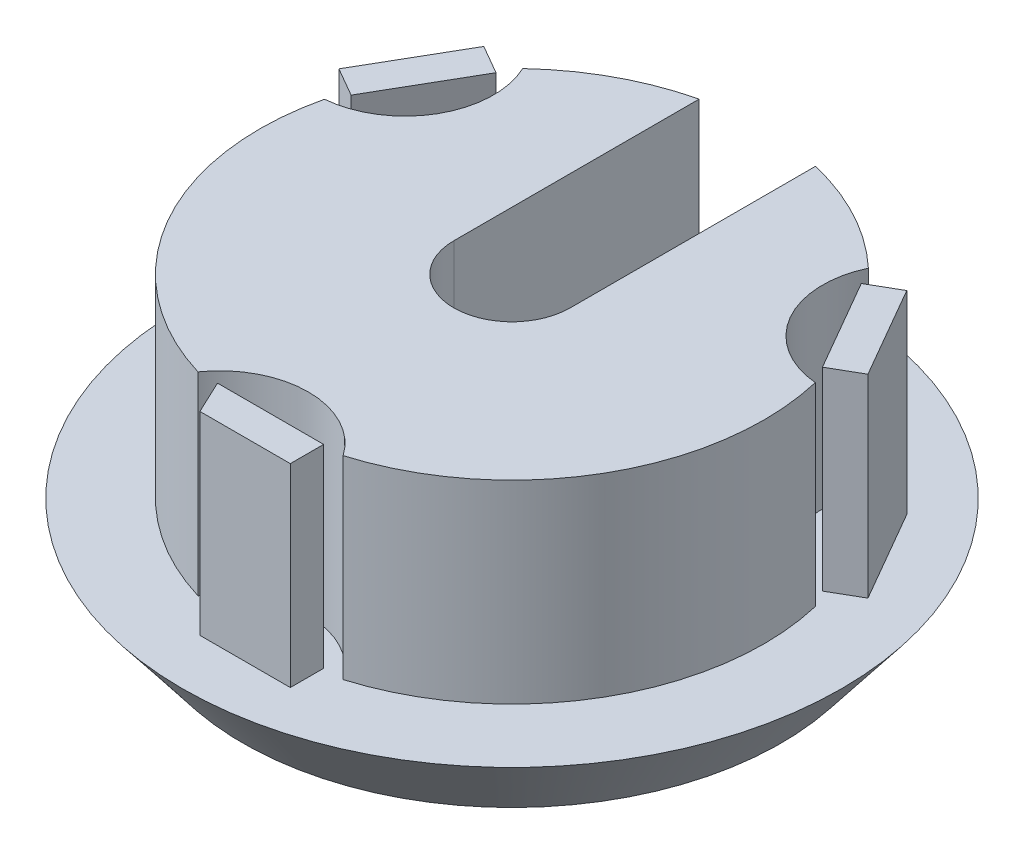
ISO-10303-21;
HEADER;
FILE_DESCRIPTION(('STEP AP214'),'2;1');
FILE_NAME('part.step','',(''),(''),'','','');
FILE_SCHEMA(('AUTOMOTIVE_DESIGN { 1 0 10303 214 1 1 1 1 }'));
ENDSEC;
DATA;
#1=APPLICATION_CONTEXT('core data for automotive mechanical design processes');
#2=APPLICATION_PROTOCOL_DEFINITION('international standard','automotive_design',2000,#1);
#3=PRODUCT_CONTEXT('',#1,'mechanical');
#4=PRODUCT('Part','Part','',(#3));
#5=PRODUCT_RELATED_PRODUCT_CATEGORY('part','',(#4));
#6=PRODUCT_DEFINITION_FORMATION('','',#4);
#7=PRODUCT_DEFINITION_CONTEXT('part definition',#1,'design');
#8=PRODUCT_DEFINITION('design','',#6,#7);
#9=PRODUCT_DEFINITION_SHAPE('','',#8);
#10=(LENGTH_UNIT() NAMED_UNIT(*) SI_UNIT(.MILLI.,.METRE.));
#11=(NAMED_UNIT(*) PLANE_ANGLE_UNIT() SI_UNIT($,.RADIAN.));
#12=(NAMED_UNIT(*) SI_UNIT($,.STERADIAN.) SOLID_ANGLE_UNIT());
#13=UNCERTAINTY_MEASURE_WITH_UNIT(LENGTH_MEASURE(1.E-05),#10,'distance_accuracy_value','');
#14=(GEOMETRIC_REPRESENTATION_CONTEXT(3) GLOBAL_UNCERTAINTY_ASSIGNED_CONTEXT((#13)) GLOBAL_UNIT_ASSIGNED_CONTEXT((#10,
#11,#12)) REPRESENTATION_CONTEXT('',''));
#15=CARTESIAN_POINT('',(0.,0.,0.));
#16=DIRECTION('',(0.,0.,1.));
#17=DIRECTION('',(1.,0.,0.));
#18=AXIS2_PLACEMENT_3D('',#15,#16,#17);
#19=CARTESIAN_POINT('',(-0.684205723735482,5.,1.18507907633929));
#20=DIRECTION('',(-0.5,0.,0.866025403784439));
#21=DIRECTION('',(0.866025403784439,0.,0.5));
#22=AXIS2_PLACEMENT_3D('',#19,#20,#21);
#23=PLANE('',#22);
#24=DIRECTION('',(-0.866025403784439,0.,-0.5));
#25=VECTOR('',#24,1.);
#26=CARTESIAN_POINT('',(-0.684205723735482,0.,1.18507907633929));
#27=LINE('',#26,#25);
#28=CARTESIAN_POINT('',(-6.07574411526303,0.,-1.92772706535534));
#29=VERTEX_POINT('',#28);
#30=CARTESIAN_POINT('',(-6.81906569315333,0.,-2.35688397844476));
#31=VERTEX_POINT('',#30);
#32=EDGE_CURVE('E111',#29,#31,#27,.T.);
#33=ORIENTED_EDGE('',*,*,#32,.F.);
#34=DIRECTION('',(0.,-1.,0.));
#35=VECTOR('',#34,1.);
#36=CARTESIAN_POINT('',(-6.07574411526303,5.,-1.92772706535534));
#37=LINE('',#36,#35);
#38=CARTESIAN_POINT('',(-6.07574411526303,5.,-1.92772706535534));
#39=VERTEX_POINT('',#38);
#40=EDGE_CURVE('E12',#39,#29,#37,.T.);
#41=ORIENTED_EDGE('',*,*,#40,.F.);
#42=DIRECTION('',(-0.866025403784439,0.,-0.5));
#43=VECTOR('',#42,1.);
#44=CARTESIAN_POINT('',(-0.684205723735482,5.,1.18507907633929));
#45=LINE('',#44,#43);
#46=CARTESIAN_POINT('',(-6.81906569315333,5.,-2.35688397844476));
#47=VERTEX_POINT('',#46);
#48=EDGE_CURVE('E96',#39,#47,#45,.T.);
#49=ORIENTED_EDGE('',*,*,#48,.T.);
#50=DIRECTION('',(0.,-1.,0.));
#51=VECTOR('',#50,1.);
#52=CARTESIAN_POINT('',(-6.81906569315333,5.,-2.35688397844476));
#53=LINE('',#52,#51);
#54=EDGE_CURVE('E64',#47,#31,#53,.T.);
#55=ORIENTED_EDGE('',*,*,#54,.T.);
#56=EDGE_LOOP('',(#33,#41,#49,#55));
#57=FACE_BOUND('',#56,.T.);
#58=ADVANCED_FACE('F48',(#57),#23,.T.);
#59=CARTESIAN_POINT('',(-5.39078812254303,5.,-3.11362759871968));
#60=DIRECTION('',(-0.865938123768216,0.,-0.500151142960588));
#61=DIRECTION('',(-0.500151142960588,0.,0.865938123768216));
#62=AXIS2_PLACEMENT_3D('',#59,#60,#61);
#63=PLANE('',#62);
#64=DIRECTION('',(0.500151142960588,0.,-0.865938123768216));
#65=VECTOR('',#64,1.);
#66=CARTESIAN_POINT('',(-5.39078812254303,0.,-3.11362759871968));
#67=LINE('',#66,#65);
#68=CARTESIAN_POINT('',(-4.70811447355037,0.,-4.29557658890527));
#69=VERTEX_POINT('',#68);
#70=EDGE_CURVE('E102',#29,#69,#67,.T.);
#71=ORIENTED_EDGE('',*,*,#70,.T.);
#72=DIRECTION('',(0.,-1.,0.));
#73=VECTOR('',#72,1.);
#74=CARTESIAN_POINT('',(-4.70811447355037,5.,-4.29557658890527));
#75=LINE('',#74,#73);
#76=CARTESIAN_POINT('',(-4.70811447355037,5.,-4.29557658890527));
#77=VERTEX_POINT('',#76);
#78=EDGE_CURVE('E56',#77,#69,#75,.T.);
#79=ORIENTED_EDGE('',*,*,#78,.F.);
#80=DIRECTION('',(0.500151142960588,0.,-0.865938123768216));
#81=VECTOR('',#80,1.);
#82=CARTESIAN_POINT('',(-5.39078812254303,5.,-3.11362759871968));
#83=LINE('',#82,#81);
#84=EDGE_CURVE('E90',#39,#77,#83,.T.);
#85=ORIENTED_EDGE('',*,*,#84,.F.);
#86=ORIENTED_EDGE('',*,*,#40,.T.);
#87=EDGE_LOOP('',(#71,#79,#85,#86));
#88=FACE_BOUND('',#87,.T.);
#89=ADVANCED_FACE('F100',(#88),#63,.F.);
#90=CARTESIAN_POINT('',(0.682673648652947,5.,-1.18194899038173));
#91=DIRECTION('',(-0.500151142960587,0.,0.865938123768216));
#92=DIRECTION('',(0.865938123768216,0.,0.500151142960587));
#93=AXIS2_PLACEMENT_3D('',#90,#91,#92);
#94=PLANE('',#93);
#95=DIRECTION('',(-0.865938123768216,0.,-0.500151142960587));
#96=VECTOR('',#95,1.);
#97=CARTESIAN_POINT('',(0.682673648652947,0.,-1.18194899038173));
#98=LINE('',#97,#96);
#99=CARTESIAN_POINT('',(-5.45136112681533,0.,-4.72486322374517));
#100=VERTEX_POINT('',#99);
#101=EDGE_CURVE('E114',#69,#100,#98,.T.);
#102=ORIENTED_EDGE('',*,*,#101,.T.);
#103=DIRECTION('',(0.,-1.,0.));
#104=VECTOR('',#103,1.);
#105=CARTESIAN_POINT('',(-5.45136112681533,5.,-4.72486322374517));
#106=LINE('',#105,#104);
#107=CARTESIAN_POINT('',(-5.45136112681533,5.,-4.72486322374517));
#108=VERTEX_POINT('',#107);
#109=EDGE_CURVE('E78',#108,#100,#106,.T.);
#110=ORIENTED_EDGE('',*,*,#109,.F.);
#111=DIRECTION('',(-0.865938123768216,0.,-0.500151142960587));
#112=VECTOR('',#111,1.);
#113=CARTESIAN_POINT('',(0.682673648652947,5.,-1.18194899038173));
#114=LINE('',#113,#112);
#115=EDGE_CURVE('E95',#77,#108,#114,.T.);
#116=ORIENTED_EDGE('',*,*,#115,.F.);
#117=ORIENTED_EDGE('',*,*,#78,.T.);
#118=EDGE_LOOP('',(#102,#110,#116,#117));
#119=FACE_BOUND('',#118,.T.);
#120=ADVANCED_FACE('F105',(#119),#94,.F.);
#121=CARTESIAN_POINT('',(-6.13403477546827,5.,-3.54291423336344));
#122=DIRECTION('',(-0.865938123768216,0.,-0.500151142960587));
#123=DIRECTION('',(-0.500151142960587,0.,0.865938123768216));
#124=AXIS2_PLACEMENT_3D('',#121,#122,#123);
#125=PLANE('',#124);
#126=DIRECTION('',(0.500151142960587,0.,-0.865938123768216));
#127=VECTOR('',#126,1.);
#128=CARTESIAN_POINT('',(-6.13403477546827,0.,-3.54291423336344));
#129=LINE('',#128,#127);
#130=EDGE_CURVE('E116',#31,#100,#129,.T.);
#131=ORIENTED_EDGE('',*,*,#130,.F.);
#132=ORIENTED_EDGE('',*,*,#54,.F.);
#133=DIRECTION('',(0.500151142960587,0.,-0.865938123768216));
#134=VECTOR('',#133,1.);
#135=CARTESIAN_POINT('',(-6.13403477546827,5.,-3.54291423336344));
#136=LINE('',#135,#134);
#137=EDGE_CURVE('E106',#47,#108,#136,.T.);
#138=ORIENTED_EDGE('',*,*,#137,.T.);
#139=ORIENTED_EDGE('',*,*,#109,.T.);
#140=EDGE_LOOP('',(#131,#132,#138,#139));
#141=FACE_BOUND('',#140,.T.);
#142=ADVANCED_FACE('F121',(#141),#125,.T.);
#143=CARTESIAN_POINT('',(0.,5.,0.));
#144=DIRECTION('',(0.,1.,0.));
#145=DIRECTION('',(0.,0.,1.));
#146=AXIS2_PLACEMENT_3D('',#143,#144,#145);
#147=PLANE('',#146);
#148=ORIENTED_EDGE('',*,*,#48,.F.);
#149=ORIENTED_EDGE('',*,*,#84,.T.);
#150=ORIENTED_EDGE('',*,*,#115,.T.);
#151=ORIENTED_EDGE('',*,*,#137,.F.);
#152=EDGE_LOOP('',(#148,#149,#150,#151));
#153=FACE_BOUND('',#152,.T.);
#154=ADVANCED_FACE('F92',(#153),#147,.T.);
#155=CARTESIAN_POINT('',(0.,0.,0.));
#156=DIRECTION('',(0.,1.,0.));
#157=DIRECTION('',(0.,0.,1.));
#158=AXIS2_PLACEMENT_3D('',#155,#156,#157);
#159=PLANE('',#158);
#160=ORIENTED_EDGE('',*,*,#32,.T.);
#161=ORIENTED_EDGE('',*,*,#130,.T.);
#162=ORIENTED_EDGE('',*,*,#101,.F.);
#163=ORIENTED_EDGE('',*,*,#70,.F.);
#164=EDGE_LOOP('',(#160,#161,#162,#163));
#165=FACE_BOUND('',#164,.T.);
#166=ADVANCED_FACE('F128',(#165),#159,.F.);
#167=CLOSED_SHELL('',(#58,#89,#120,#142,#154,#166));
#168=MANIFOLD_SOLID_BREP('B2',#167);
#169=CARTESIAN_POINT('',(-0.684205723736076,5.,-1.18507907634032));
#170=DIRECTION('',(-0.5,0.,-0.866025403784439));
#171=DIRECTION('',(-0.866025403784439,0.,0.5));
#172=AXIS2_PLACEMENT_3D('',#169,#170,#171);
#173=PLANE('',#172);
#174=DIRECTION('',(0.866025403784439,0.,-0.5));
#175=VECTOR('',#174,1.);
#176=CARTESIAN_POINT('',(-0.684205723736076,0.,-1.18507907634032));
#177=LINE('',#176,#175);
#178=CARTESIAN_POINT('',(4.70733266790989,0.,-4.29788521810332));
#179=VERTEX_POINT('',#178);
#180=CARTESIAN_POINT('',(5.4506542458002,0.,-4.72704213119274));
#181=VERTEX_POINT('',#180);
#182=EDGE_CURVE('E251',#179,#181,#177,.T.);
#183=ORIENTED_EDGE('',*,*,#182,.F.);
#184=DIRECTION('',(0.,-1.,0.));
#185=VECTOR('',#184,1.);
#186=CARTESIAN_POINT('',(4.70733266790989,5.,-4.29788521810332));
#187=LINE('',#186,#185);
#188=CARTESIAN_POINT('',(4.70733266790989,5.,-4.29788521810332));
#189=VERTEX_POINT('',#188);
#190=EDGE_CURVE('E46',#189,#179,#187,.T.);
#191=ORIENTED_EDGE('',*,*,#190,.F.);
#192=DIRECTION('',(0.866025403784439,0.,-0.5));
#193=VECTOR('',#192,1.);
#194=CARTESIAN_POINT('',(-0.684205723736076,5.,-1.18507907634032));
#195=LINE('',#194,#193);
#196=CARTESIAN_POINT('',(5.4506542458002,5.,-4.72704213119274));
#197=VERTEX_POINT('',#196);
#198=EDGE_CURVE('E236',#189,#197,#195,.T.);
#199=ORIENTED_EDGE('',*,*,#198,.T.);
#200=DIRECTION('',(0.,-1.,0.));
#201=VECTOR('',#200,1.);
#202=CARTESIAN_POINT('',(5.4506542458002,5.,-4.72704213119274));
#203=LINE('',#202,#201);
#204=EDGE_CURVE('E204',#197,#181,#203,.T.);
#205=ORIENTED_EDGE('',*,*,#204,.T.);
#206=EDGE_LOOP('',(#183,#191,#199,#205));
#207=FACE_BOUND('',#206,.T.);
#208=ADVANCED_FACE('F188',(#207),#173,.T.);
#209=CARTESIAN_POINT('',(5.39187465980554,5.,-3.11174566125019));
#210=DIRECTION('',(0.866112657419799,0.,-0.499848841808414));
#211=DIRECTION('',(-0.499848841808414,0.,-0.866112657419799));
#212=AXIS2_PLACEMENT_3D('',#209,#210,#211);
#213=PLANE('',#212);
#214=DIRECTION('',(0.499848841808414,0.,0.866112657419799));
#215=VECTOR('',#214,1.);
#216=CARTESIAN_POINT('',(5.39187465980554,0.,-3.11174566125019));
#217=LINE('',#216,#215);
#218=CARTESIAN_POINT('',(6.07413568678665,0.,-1.92955844363664));
#219=VERTEX_POINT('',#218);
#220=EDGE_CURVE('E242',#179,#219,#217,.T.);
#221=ORIENTED_EDGE('',*,*,#220,.T.);
#222=DIRECTION('',(0.,-1.,0.));
#223=VECTOR('',#222,1.);
#224=CARTESIAN_POINT('',(6.07413568678665,5.,-1.92955844363664));
#225=LINE('',#224,#223);
#226=CARTESIAN_POINT('',(6.07413568678665,5.,-1.92955844363664));
#227=VERTEX_POINT('',#226);
#228=EDGE_CURVE('E196',#227,#219,#225,.T.);
#229=ORIENTED_EDGE('',*,*,#228,.F.);
#230=DIRECTION('',(0.499848841808414,0.,0.866112657419799));
#231=VECTOR('',#230,1.);
#232=CARTESIAN_POINT('',(5.39187465980554,5.,-3.11174566125019));
#233=LINE('',#232,#231);
#234=EDGE_CURVE('E230',#189,#227,#233,.T.);
#235=ORIENTED_EDGE('',*,*,#234,.F.);
#236=ORIENTED_EDGE('',*,*,#190,.T.);
#237=EDGE_LOOP('',(#221,#229,#235,#236));
#238=FACE_BOUND('',#237,.T.);
#239=ADVANCED_FACE('F240',(#238),#213,.F.);
#240=CARTESIAN_POINT('',(0.682261027320872,5.,1.18218721741748));
#241=DIRECTION('',(-0.499848841808415,0.,-0.866112657419799));
#242=DIRECTION('',(-0.866112657419799,0.,0.499848841808415));
#243=AXIS2_PLACEMENT_3D('',#240,#241,#242);
#244=PLANE('',#243);
#245=DIRECTION('',(0.866112657419799,0.,-0.499848841808416));
#246=VECTOR('',#245,1.);
#247=CARTESIAN_POINT('',(0.682261027320872,0.,1.18218721741748));
#248=LINE('',#247,#246);
#249=CARTESIAN_POINT('',(6.81753214469565,0.,-2.35858560922185));
#250=VERTEX_POINT('',#249);
#251=EDGE_CURVE('E254',#219,#250,#248,.T.);
#252=ORIENTED_EDGE('',*,*,#251,.T.);
#253=DIRECTION('',(0.,-1.,0.));
#254=VECTOR('',#253,1.);
#255=CARTESIAN_POINT('',(6.81753214469565,5.,-2.35858560922185));
#256=LINE('',#255,#254);
#257=CARTESIAN_POINT('',(6.81753214469565,5.,-2.35858560922185));
#258=VERTEX_POINT('',#257);
#259=EDGE_CURVE('E218',#258,#250,#256,.T.);
#260=ORIENTED_EDGE('',*,*,#259,.F.);
#261=DIRECTION('',(0.866112657419799,0.,-0.499848841808416));
#262=VECTOR('',#261,1.);
#263=CARTESIAN_POINT('',(0.682261027320872,5.,1.18218721741748));
#264=LINE('',#263,#262);
#265=EDGE_CURVE('E235',#227,#258,#264,.T.);
#266=ORIENTED_EDGE('',*,*,#265,.F.);
#267=ORIENTED_EDGE('',*,*,#228,.T.);
#268=EDGE_LOOP('',(#252,#260,#266,#267));
#269=FACE_BOUND('',#268,.T.);
#270=ADVANCED_FACE('F245',(#269),#244,.F.);
#271=CARTESIAN_POINT('',(6.13527111737479,5.,-3.54077282663933));
#272=DIRECTION('',(0.866112657419799,0.,-0.499848841808414));
#273=DIRECTION('',(-0.499848841808414,0.,-0.866112657419799));
#274=AXIS2_PLACEMENT_3D('',#271,#272,#273);
#275=PLANE('',#274);
#276=DIRECTION('',(0.499848841808414,0.,0.866112657419799));
#277=VECTOR('',#276,1.);
#278=CARTESIAN_POINT('',(6.13527111737479,0.,-3.54077282663933));
#279=LINE('',#278,#277);
#280=EDGE_CURVE('E256',#181,#250,#279,.T.);
#281=ORIENTED_EDGE('',*,*,#280,.F.);
#282=ORIENTED_EDGE('',*,*,#204,.F.);
#283=DIRECTION('',(0.499848841808414,0.,0.866112657419799));
#284=VECTOR('',#283,1.);
#285=CARTESIAN_POINT('',(6.13527111737479,5.,-3.54077282663933));
#286=LINE('',#285,#284);
#287=EDGE_CURVE('E246',#197,#258,#286,.T.);
#288=ORIENTED_EDGE('',*,*,#287,.T.);
#289=ORIENTED_EDGE('',*,*,#259,.T.);
#290=EDGE_LOOP('',(#281,#282,#288,#289));
#291=FACE_BOUND('',#290,.T.);
#292=ADVANCED_FACE('F261',(#291),#275,.T.);
#293=CARTESIAN_POINT('',(0.,5.,0.));
#294=DIRECTION('',(0.,1.,0.));
#295=DIRECTION('',(0.,0.,1.));
#296=AXIS2_PLACEMENT_3D('',#293,#294,#295);
#297=PLANE('',#296);
#298=ORIENTED_EDGE('',*,*,#198,.F.);
#299=ORIENTED_EDGE('',*,*,#234,.T.);
#300=ORIENTED_EDGE('',*,*,#265,.T.);
#301=ORIENTED_EDGE('',*,*,#287,.F.);
#302=EDGE_LOOP('',(#298,#299,#300,#301));
#303=FACE_BOUND('',#302,.T.);
#304=ADVANCED_FACE('F232',(#303),#297,.T.);
#305=CARTESIAN_POINT('',(0.,0.,0.));
#306=DIRECTION('',(0.,1.,0.));
#307=DIRECTION('',(0.,0.,1.));
#308=AXIS2_PLACEMENT_3D('',#305,#306,#307);
#309=PLANE('',#308);
#310=ORIENTED_EDGE('',*,*,#182,.T.);
#311=ORIENTED_EDGE('',*,*,#280,.T.);
#312=ORIENTED_EDGE('',*,*,#251,.F.);
#313=ORIENTED_EDGE('',*,*,#220,.F.);
#314=EDGE_LOOP('',(#310,#311,#312,#313));
#315=FACE_BOUND('',#314,.T.);
#316=ADVANCED_FACE('F268',(#315),#309,.F.);
#317=CLOSED_SHELL('',(#208,#239,#270,#292,#304,#316));
#318=MANIFOLD_SOLID_BREP('B6',#317);
#319=CARTESIAN_POINT('',(0.,5.,7.08351927889812));
#320=DIRECTION('',(0.,0.,1.));
#321=DIRECTION('',(1.,0.,0.));
#322=AXIS2_PLACEMENT_3D('',#319,#320,#321);
#323=PLANE('',#322);
#324=DIRECTION('',(-1.,0.,0.));
#325=VECTOR('',#324,1.);
#326=CARTESIAN_POINT('',(0.,0.,7.08351927889812));
#327=LINE('',#326,#325);
#328=CARTESIAN_POINT('',(1.36841144758998,0.,7.08351927889812));
#329=VERTEX_POINT('',#328);
#330=CARTESIAN_POINT('',(-0.962547238264103,0.,7.08351927889812));
#331=VERTEX_POINT('',#330);
#332=EDGE_CURVE('E391',#329,#331,#327,.T.);
#333=ORIENTED_EDGE('',*,*,#332,.F.);
#334=DIRECTION('',(0.,-1.,0.));
#335=VECTOR('',#334,1.);
#336=CARTESIAN_POINT('',(1.36841144758998,5.,7.08351927889812));
#337=LINE('',#336,#335);
#338=CARTESIAN_POINT('',(1.36841144758998,5.,7.08351927889812));
#339=VERTEX_POINT('',#338);
#340=EDGE_CURVE('E186',#339,#329,#337,.T.);
#341=ORIENTED_EDGE('',*,*,#340,.F.);
#342=DIRECTION('',(-1.,0.,0.));
#343=VECTOR('',#342,1.);
#344=CARTESIAN_POINT('',(0.,5.,7.08351927889812));
#345=LINE('',#344,#343);
#346=CARTESIAN_POINT('',(-0.962547238264103,5.,7.08351927889812));
#347=VERTEX_POINT('',#346);
#348=EDGE_CURVE('E385',#339,#347,#345,.T.);
#349=ORIENTED_EDGE('',*,*,#348,.T.);
#350=DIRECTION('',(0.,-1.,0.));
#351=VECTOR('',#350,1.);
#352=CARTESIAN_POINT('',(-0.962547238264103,5.,7.08351927889812));
#353=LINE('',#352,#351);
#354=EDGE_CURVE('E366',#347,#331,#353,.T.);
#355=ORIENTED_EDGE('',*,*,#354,.T.);
#356=EDGE_LOOP('',(#333,#341,#349,#355));
#357=FACE_BOUND('',#356,.T.);
#358=ADVANCED_FACE('F328',(#357),#323,.T.);
#359=CARTESIAN_POINT('',(1.36841144758998,5.,0.));
#360=DIRECTION('',(1.,0.,0.));
#361=DIRECTION('',(0.,0.,-1.));
#362=AXIS2_PLACEMENT_3D('',#359,#360,#361);
#363=PLANE('',#362);
#364=DIRECTION('',(0.,0.,1.));
#365=VECTOR('',#364,1.);
#366=CARTESIAN_POINT('',(1.36841144758998,0.,0.));
#367=LINE('',#366,#365);
#368=CARTESIAN_POINT('',(1.36841144758998,0.,6.22513503293207));
#369=VERTEX_POINT('',#368);
#370=EDGE_CURVE('E379',#369,#329,#367,.T.);
#371=ORIENTED_EDGE('',*,*,#370,.F.);
#372=DIRECTION('',(0.,-1.,0.));
#373=VECTOR('',#372,1.);
#374=CARTESIAN_POINT('',(1.36841144758998,5.,6.22513503293207));
#375=LINE('',#374,#373);
#376=CARTESIAN_POINT('',(1.36841144758998,5.,6.22513503293207));
#377=VERTEX_POINT('',#376);
#378=EDGE_CURVE('E336',#377,#369,#375,.T.);
#379=ORIENTED_EDGE('',*,*,#378,.F.);
#380=DIRECTION('',(0.,0.,1.));
#381=VECTOR('',#380,1.);
#382=CARTESIAN_POINT('',(1.36841144758998,5.,0.));
#383=LINE('',#382,#381);
#384=EDGE_CURVE('E377',#377,#339,#383,.T.);
#385=ORIENTED_EDGE('',*,*,#384,.T.);
#386=ORIENTED_EDGE('',*,*,#340,.T.);
#387=EDGE_LOOP('',(#371,#379,#385,#386));
#388=FACE_BOUND('',#387,.T.);
#389=ADVANCED_FACE('F375',(#388),#363,.T.);
#390=CARTESIAN_POINT('',(-7.54564609300495E-10,5.,6.22513503270538));
#391=DIRECTION('',(-1.21212568938054E-10,0.,1.));
#392=DIRECTION('',(1.,0.,1.21212568938054E-10));
#393=AXIS2_PLACEMENT_3D('',#390,#391,#392);
#394=PLANE('',#393);
#395=DIRECTION('',(-1.,0.,-1.21212568938054E-10));
#396=VECTOR('',#395,1.);
#397=CARTESIAN_POINT('',(-7.54564609300495E-10,0.,6.22513503270538));
#398=LINE('',#397,#396);
#399=CARTESIAN_POINT('',(-1.3660212129994,0.,6.2251350325398));
#400=VERTEX_POINT('',#399);
#401=EDGE_CURVE('E359',#369,#400,#398,.T.);
#402=ORIENTED_EDGE('',*,*,#401,.T.);
#403=DIRECTION('',(0.,-1.,0.));
#404=VECTOR('',#403,1.);
#405=CARTESIAN_POINT('',(-1.3660212129994,5.,6.2251350325398));
#406=LINE('',#405,#404);
#407=CARTESIAN_POINT('',(-1.3660212129994,5.,6.2251350325398));
#408=VERTEX_POINT('',#407);
#409=EDGE_CURVE('E380',#408,#400,#406,.T.);
#410=ORIENTED_EDGE('',*,*,#409,.F.);
#411=DIRECTION('',(-1.,0.,-1.21212568938054E-10));
#412=VECTOR('',#411,1.);
#413=CARTESIAN_POINT('',(-7.54564609300495E-10,5.,6.22513503270538));
#414=LINE('',#413,#412);
#415=EDGE_CURVE('E381',#377,#408,#414,.T.);
#416=ORIENTED_EDGE('',*,*,#415,.F.);
#417=ORIENTED_EDGE('',*,*,#378,.T.);
#418=EDGE_LOOP('',(#402,#410,#416,#417));
#419=FACE_BOUND('',#418,.T.);
#420=ADVANCED_FACE('F382',(#419),#394,.F.);
#421=CARTESIAN_POINT('',(-3.51539703990695,5.,1.65237330849183));
#422=DIRECTION('',(0.905010153623972,0.,-0.425389964429715));
#423=DIRECTION('',(-0.425389964429715,0.,-0.905010153623972));
#424=AXIS2_PLACEMENT_3D('',#421,#422,#423);
#425=PLANE('',#424);
#426=DIRECTION('',(0.425389964429715,0.,0.905010153623972));
#427=VECTOR('',#426,1.);
#428=CARTESIAN_POINT('',(-3.51539703990695,0.,1.65237330849183));
#429=LINE('',#428,#427);
#430=EDGE_CURVE('E387',#400,#331,#429,.T.);
#431=ORIENTED_EDGE('',*,*,#430,.T.);
#432=ORIENTED_EDGE('',*,*,#354,.F.);
#433=DIRECTION('',(0.425389964429715,0.,0.905010153623972));
#434=VECTOR('',#433,1.);
#435=CARTESIAN_POINT('',(-3.51539703990695,5.,1.65237330849183));
#436=LINE('',#435,#434);
#437=EDGE_CURVE('E344',#408,#347,#436,.T.);
#438=ORIENTED_EDGE('',*,*,#437,.F.);
#439=ORIENTED_EDGE('',*,*,#409,.T.);
#440=EDGE_LOOP('',(#431,#432,#438,#439));
#441=FACE_BOUND('',#440,.T.);
#442=ADVANCED_FACE('F400',(#441),#425,.F.);
#443=CARTESIAN_POINT('',(0.,5.,0.));
#444=DIRECTION('',(0.,1.,0.));
#445=DIRECTION('',(0.,0.,1.));
#446=AXIS2_PLACEMENT_3D('',#443,#444,#445);
#447=PLANE('',#446);
#448=ORIENTED_EDGE('',*,*,#348,.F.);
#449=ORIENTED_EDGE('',*,*,#384,.F.);
#450=ORIENTED_EDGE('',*,*,#415,.T.);
#451=ORIENTED_EDGE('',*,*,#437,.T.);
#452=EDGE_LOOP('',(#448,#449,#450,#451));
#453=FACE_BOUND('',#452,.T.);
#454=ADVANCED_FACE('F384',(#453),#447,.T.);
#455=CARTESIAN_POINT('',(0.,0.,0.));
#456=DIRECTION('',(0.,1.,0.));
#457=DIRECTION('',(0.,0.,1.));
#458=AXIS2_PLACEMENT_3D('',#455,#456,#457);
#459=PLANE('',#458);
#460=ORIENTED_EDGE('',*,*,#332,.T.);
#461=ORIENTED_EDGE('',*,*,#430,.F.);
#462=ORIENTED_EDGE('',*,*,#401,.F.);
#463=ORIENTED_EDGE('',*,*,#370,.T.);
#464=EDGE_LOOP('',(#460,#461,#462,#463));
#465=FACE_BOUND('',#464,.T.);
#466=ADVANCED_FACE('F402',(#465),#459,.F.);
#467=CLOSED_SHELL('',(#358,#389,#420,#442,#454,#466));
#468=MANIFOLD_SOLID_BREP('B40',#467);
#469=CARTESIAN_POINT('',(-1.1,-1.15405143236558,-1.32455532033676));
#470=DIRECTION('',(0.,1.,0.));
#471=DIRECTION('',(0.,0.,1.));
#472=AXIS2_PLACEMENT_3D('',#469,#470,#471);
#473=PLANE('',#472);
#474=DIRECTION('',(1.,0.,0.));
#475=VECTOR('',#474,1.);
#476=CARTESIAN_POINT('',(-1.1,-1.15405143236558,-6.32455532033676));
#477=LINE('',#476,#475);
#478=CARTESIAN_POINT('',(-1.1,-1.15405143236558,-6.32455532033676));
#479=VERTEX_POINT('',#478);
#480=CARTESIAN_POINT('',(1.1,-1.15405143236558,-6.32455532033676));
#481=VERTEX_POINT('',#480);
#482=EDGE_CURVE('E527',#479,#481,#477,.T.);
#483=ORIENTED_EDGE('',*,*,#482,.F.);
#484=DIRECTION('',(0.,0.,-1.));
#485=VECTOR('',#484,1.);
#486=CARTESIAN_POINT('',(-1.1,-1.15405143236558,-1.32455532033676));
#487=LINE('',#486,#485);
#488=CARTESIAN_POINT('',(-1.1,-1.15405143236558,-1.32455532033676));
#489=VERTEX_POINT('',#488);
#490=EDGE_CURVE('E326',#489,#479,#487,.T.);
#491=ORIENTED_EDGE('',*,*,#490,.F.);
#492=DIRECTION('',(1.,0.,0.));
#493=VECTOR('',#492,1.);
#494=CARTESIAN_POINT('',(-1.1,-1.15405143236558,-1.32455532033676));
#495=LINE('',#494,#493);
#496=CARTESIAN_POINT('',(1.1,-1.15405143236558,-1.32455532033676));
#497=VERTEX_POINT('',#496);
#498=EDGE_CURVE('E521',#489,#497,#495,.T.);
#499=ORIENTED_EDGE('',*,*,#498,.T.);
#500=DIRECTION('',(0.,0.,-1.));
#501=VECTOR('',#500,1.);
#502=CARTESIAN_POINT('',(1.1,-1.15405143236558,-1.32455532033676));
#503=LINE('',#502,#501);
#504=EDGE_CURVE('E466',#497,#481,#503,.T.);
#505=ORIENTED_EDGE('',*,*,#504,.T.);
#506=EDGE_LOOP('',(#483,#491,#499,#505));
#507=FACE_BOUND('',#506,.T.);
#508=ADVANCED_FACE('F463',(#507),#473,.T.);
#509=CARTESIAN_POINT('',(-1.1,-2.,-1.32455532033676));
#510=DIRECTION('',(-1.,0.,0.));
#511=DIRECTION('',(0.,0.,1.));
#512=AXIS2_PLACEMENT_3D('',#509,#510,#511);
#513=PLANE('',#512);
#514=DIRECTION('',(0.,1.,0.));
#515=VECTOR('',#514,1.);
#516=CARTESIAN_POINT('',(-1.1,-2.,-6.32455532033676));
#517=LINE('',#516,#515);
#518=CARTESIAN_POINT('',(-1.1,-2.,-6.32455532033676));
#519=VERTEX_POINT('',#518);
#520=EDGE_CURVE('E523',#519,#479,#517,.T.);
#521=ORIENTED_EDGE('',*,*,#520,.F.);
#522=DIRECTION('',(0.,0.,-1.));
#523=VECTOR('',#522,1.);
#524=CARTESIAN_POINT('',(-1.1,-2.,-1.32455532033676));
#525=LINE('',#524,#523);
#526=CARTESIAN_POINT('',(-1.1,-2.,-1.32455532033676));
#527=VERTEX_POINT('',#526);
#528=EDGE_CURVE('E472',#527,#519,#525,.T.);
#529=ORIENTED_EDGE('',*,*,#528,.F.);
#530=DIRECTION('',(0.,1.,0.));
#531=VECTOR('',#530,1.);
#532=CARTESIAN_POINT('',(-1.1,-2.,-1.32455532033676));
#533=LINE('',#532,#531);
#534=EDGE_CURVE('E511',#527,#489,#533,.T.);
#535=ORIENTED_EDGE('',*,*,#534,.T.);
#536=ORIENTED_EDGE('',*,*,#490,.T.);
#537=EDGE_LOOP('',(#521,#529,#535,#536));
#538=FACE_BOUND('',#537,.T.);
#539=ADVANCED_FACE('F537',(#538),#513,.T.);
#540=CARTESIAN_POINT('',(-1.1,-2.,-1.32455532033676));
#541=DIRECTION('',(0.,1.,0.));
#542=DIRECTION('',(0.,0.,1.));
#543=AXIS2_PLACEMENT_3D('',#540,#541,#542);
#544=PLANE('',#543);
#545=DIRECTION('',(1.,0.,0.));
#546=VECTOR('',#545,1.);
#547=CARTESIAN_POINT('',(-1.1,-2.,-6.32455532033676));
#548=LINE('',#547,#546);
#549=CARTESIAN_POINT('',(1.1,-2.,-6.32455532033676));
#550=VERTEX_POINT('',#549);
#551=EDGE_CURVE('E516',#519,#550,#548,.T.);
#552=ORIENTED_EDGE('',*,*,#551,.T.);
#553=DIRECTION('',(0.,0.,-1.));
#554=VECTOR('',#553,1.);
#555=CARTESIAN_POINT('',(1.1,-2.,-1.32455532033676));
#556=LINE('',#555,#554);
#557=CARTESIAN_POINT('',(1.1,-2.,-1.32455532033676));
#558=VERTEX_POINT('',#557);
#559=EDGE_CURVE('E514',#558,#550,#556,.T.);
#560=ORIENTED_EDGE('',*,*,#559,.F.);
#561=DIRECTION('',(1.,0.,0.));
#562=VECTOR('',#561,1.);
#563=CARTESIAN_POINT('',(-1.1,-2.,-1.32455532033676));
#564=LINE('',#563,#562);
#565=EDGE_CURVE('E508',#527,#558,#564,.T.);
#566=ORIENTED_EDGE('',*,*,#565,.F.);
#567=ORIENTED_EDGE('',*,*,#528,.T.);
#568=EDGE_LOOP('',(#552,#560,#566,#567));
#569=FACE_BOUND('',#568,.T.);
#570=ADVANCED_FACE('F515',(#569),#544,.F.);
#571=CARTESIAN_POINT('',(1.1,-2.,-1.32455532033676));
#572=DIRECTION('',(-1.,0.,0.));
#573=DIRECTION('',(0.,0.,1.));
#574=AXIS2_PLACEMENT_3D('',#571,#572,#573);
#575=PLANE('',#574);
#576=DIRECTION('',(0.,1.,0.));
#577=VECTOR('',#576,1.);
#578=CARTESIAN_POINT('',(1.1,-2.,-6.32455532033676));
#579=LINE('',#578,#577);
#580=EDGE_CURVE('E530',#550,#481,#579,.T.);
#581=ORIENTED_EDGE('',*,*,#580,.T.);
#582=ORIENTED_EDGE('',*,*,#504,.F.);
#583=DIRECTION('',(0.,1.,0.));
#584=VECTOR('',#583,1.);
#585=CARTESIAN_POINT('',(1.1,-2.,-1.32455532033676));
#586=LINE('',#585,#584);
#587=EDGE_CURVE('E505',#558,#497,#586,.T.);
#588=ORIENTED_EDGE('',*,*,#587,.F.);
#589=ORIENTED_EDGE('',*,*,#559,.T.);
#590=EDGE_LOOP('',(#581,#582,#588,#589));
#591=FACE_BOUND('',#590,.T.);
#592=ADVANCED_FACE('F520',(#591),#575,.F.);
#593=CARTESIAN_POINT('',(0.,0.,-1.32455532033676));
#594=DIRECTION('',(0.,0.,1.));
#595=DIRECTION('',(1.,0.,0.));
#596=AXIS2_PLACEMENT_3D('',#593,#594,#595);
#597=PLANE('',#596);
#598=ORIENTED_EDGE('',*,*,#498,.F.);
#599=ORIENTED_EDGE('',*,*,#534,.F.);
#600=ORIENTED_EDGE('',*,*,#565,.T.);
#601=ORIENTED_EDGE('',*,*,#587,.T.);
#602=EDGE_LOOP('',(#598,#599,#600,#601));
#603=FACE_BOUND('',#602,.T.);
#604=ADVANCED_FACE('F510',(#603),#597,.T.);
#605=CARTESIAN_POINT('',(0.,0.,-6.32455532033676));
#606=DIRECTION('',(0.,0.,1.));
#607=DIRECTION('',(1.,0.,0.));
#608=AXIS2_PLACEMENT_3D('',#605,#606,#607);
#609=PLANE('',#608);
#610=ORIENTED_EDGE('',*,*,#482,.T.);
#611=ORIENTED_EDGE('',*,*,#580,.F.);
#612=ORIENTED_EDGE('',*,*,#551,.F.);
#613=ORIENTED_EDGE('',*,*,#520,.T.);
#614=EDGE_LOOP('',(#610,#611,#612,#613));
#615=FACE_BOUND('',#614,.T.);
#616=ADVANCED_FACE('F536',(#615),#609,.F.);
#617=CLOSED_SHELL('',(#508,#539,#570,#592,#604,#616));
#618=MANIFOLD_SOLID_BREP('B180',#617);
#619=CARTESIAN_POINT('',(0.,0.,0.));
#620=DIRECTION('',(0.,1.,0.));
#621=DIRECTION('',(0.,0.,-1.));
#622=AXIS2_PLACEMENT_3D('',#619,#620,#621);
#623=CONICAL_SURFACE('',#622,8.5,0.663225115757846);
#624=CARTESIAN_POINT('',(0.,-2.,0.));
#625=DIRECTION('',(0.,-1.,0.));
#626=DIRECTION('',(0.,0.,-1.));
#627=AXIS2_PLACEMENT_3D('',#624,#625,#626);
#628=CIRCLE('',#627,6.93742874698656);
#629=CARTESIAN_POINT('',(0.,-2.,-6.93742874698656));
#630=VERTEX_POINT('',#629);
#631=EDGE_CURVE('E462',#630,#630,#628,.T.);
#632=ORIENTED_EDGE('',*,*,#631,.F.);
#633=EDGE_LOOP('',(#632));
#634=FACE_BOUND('',#633,.T.);
#635=CARTESIAN_POINT('',(0.,0.,0.));
#636=DIRECTION('',(0.,-1.,0.));
#637=DIRECTION('',(0.,0.,-1.));
#638=AXIS2_PLACEMENT_3D('',#635,#636,#637);
#639=CIRCLE('',#638,8.5);
#640=CARTESIAN_POINT('',(0.,0.,-8.5));
#641=VERTEX_POINT('',#640);
#642=EDGE_CURVE('E602',#641,#641,#639,.T.);
#643=ORIENTED_EDGE('',*,*,#642,.T.);
#644=EDGE_LOOP('',(#643));
#645=FACE_BOUND('',#644,.T.);
#646=ADVANCED_FACE('F596',(#634,#645),#623,.T.);
#647=CARTESIAN_POINT('',(0.,-2.,0.));
#648=DIRECTION('',(0.,-1.,0.));
#649=DIRECTION('',(0.,0.,-1.));
#650=AXIS2_PLACEMENT_3D('',#647,#648,#649);
#651=PLANE('',#650);
#652=ORIENTED_EDGE('',*,*,#631,.T.);
#653=EDGE_LOOP('',(#652));
#654=FACE_BOUND('',#653,.T.);
#655=ADVANCED_FACE('F611',(#654),#651,.T.);
#656=CARTESIAN_POINT('',(0.,0.,0.));
#657=DIRECTION('',(0.,-1.,0.));
#658=DIRECTION('',(0.,0.,-1.));
#659=AXIS2_PLACEMENT_3D('',#656,#657,#658);
#660=PLANE('',#659);
#661=ORIENTED_EDGE('',*,*,#642,.F.);
#662=EDGE_LOOP('',(#661));
#663=FACE_BOUND('',#662,.T.);
#664=ADVANCED_FACE('F609',(#663),#660,.F.);
#665=CLOSED_SHELL('',(#646,#655,#664));
#666=MANIFOLD_SOLID_BREP('B320',#665);
#667=CARTESIAN_POINT('',(0.,5.,0.));
#668=DIRECTION('',(0.,-1.,0.));
#669=DIRECTION('',(0.,0.,-1.));
#670=AXIS2_PLACEMENT_3D('',#667,#668,#669);
#671=CYLINDRICAL_SURFACE('',#670,6.5);
#672=DIRECTION('',(0.,1.,0.));
#673=VECTOR('',#672,1.);
#674=CARTESIAN_POINT('',(-1.5,-11.,-6.32455532033676));
#675=LINE('',#674,#673);
#676=CARTESIAN_POINT('',(-1.5,0.,-6.32455532033676));
#677=VERTEX_POINT('',#676);
#678=CARTESIAN_POINT('',(-1.5,5.,-6.32455532033676));
#679=VERTEX_POINT('',#678);
#680=EDGE_CURVE('E729',#677,#679,#675,.T.);
#681=ORIENTED_EDGE('',*,*,#680,.F.);
#682=CARTESIAN_POINT('',(0.,0.,0.));
#683=DIRECTION('',(0.,1.,0.));
#684=DIRECTION('',(0.,0.,1.));
#685=AXIS2_PLACEMENT_3D('',#682,#683,#684);
#686=CIRCLE('',#685,6.5);
#687=CARTESIAN_POINT('',(-4.4560189593082,0.,-4.73221882781068));
#688=VERTEX_POINT('',#687);
#689=EDGE_CURVE('E748',#677,#688,#686,.T.);
#690=ORIENTED_EDGE('',*,*,#689,.T.);
#691=DIRECTION('',(0.,-1.,0.));
#692=VECTOR('',#691,1.);
#693=CARTESIAN_POINT('',(-4.4560189593082,18.,-4.73221882781068));
#694=LINE('',#693,#692);
#695=CARTESIAN_POINT('',(-4.4560189593082,5.,-4.73221882781068));
#696=VERTEX_POINT('',#695);
#697=EDGE_CURVE('E786',#696,#688,#694,.T.);
#698=ORIENTED_EDGE('',*,*,#697,.F.);
#699=CARTESIAN_POINT('',(0.,5.,0.));
#700=DIRECTION('',(0.,1.,0.));
#701=DIRECTION('',(0.,0.,1.));
#702=AXIS2_PLACEMENT_3D('',#699,#700,#701);
#703=CIRCLE('',#702,6.5);
#704=EDGE_CURVE('E736',#679,#696,#703,.T.);
#705=ORIENTED_EDGE('',*,*,#704,.F.);
#706=EDGE_LOOP('',(#681,#690,#698,#705));
#707=FACE_BOUND('',#706,.T.);
#708=ADVANCED_FACE('F637',(#707),#671,.T.);
#709=DIRECTION('',(0.,1.,0.));
#710=VECTOR('',#709,1.);
#711=CARTESIAN_POINT('',(1.5,-11.,-6.32455532033676));
#712=LINE('',#711,#710);
#713=CARTESIAN_POINT('',(1.5,0.,-6.32455532033676));
#714=VERTEX_POINT('',#713);
#715=CARTESIAN_POINT('',(1.5,5.,-6.32455532033676));
#716=VERTEX_POINT('',#715);
#717=EDGE_CURVE('E651',#714,#716,#712,.T.);
#718=ORIENTED_EDGE('',*,*,#717,.T.);
#719=CARTESIAN_POINT('',(4.4560189604554,5.,-4.73221882673044));
#720=VERTEX_POINT('',#719);
#721=EDGE_CURVE('E726',#720,#716,#703,.T.);
#722=ORIENTED_EDGE('',*,*,#721,.F.);
#723=DIRECTION('',(0.,-1.,0.));
#724=VECTOR('',#723,1.);
#725=CARTESIAN_POINT('',(4.4560189604554,18.,-4.73221882673044));
#726=LINE('',#725,#724);
#727=CARTESIAN_POINT('',(4.4560189604554,0.,-4.73221882673044));
#728=VERTEX_POINT('',#727);
#729=EDGE_CURVE('E778',#720,#728,#726,.T.);
#730=ORIENTED_EDGE('',*,*,#729,.T.);
#731=EDGE_CURVE('E728',#728,#714,#686,.T.);
#732=ORIENTED_EDGE('',*,*,#731,.T.);
#733=EDGE_LOOP('',(#718,#722,#730,#732));
#734=FACE_BOUND('',#733,.T.);
#735=ADVANCED_FACE('F724',(#734),#671,.T.);
#736=CARTESIAN_POINT('',(0.,5.,0.));
#737=DIRECTION('',(0.,1.,0.));
#738=DIRECTION('',(0.,0.,1.));
#739=AXIS2_PLACEMENT_3D('',#736,#737,#738);
#740=PLANE('',#739);
#741=CARTESIAN_POINT('',(0.,5.,0.));
#742=DIRECTION('',(0.,1.,0.));
#743=DIRECTION('',(0.,0.,1.));
#744=AXIS2_PLACEMENT_3D('',#741,#742,#743);
#745=CIRCLE('',#744,1.5);
#746=CARTESIAN_POINT('',(1.5,5.,0.));
#747=VERTEX_POINT('',#746);
#748=CARTESIAN_POINT('',(-1.5,5.,0.));
#749=VERTEX_POINT('',#748);
#750=EDGE_CURVE('E777',#747,#749,#745,.F.);
#751=ORIENTED_EDGE('',*,*,#750,.T.);
#752=DIRECTION('',(0.,0.,-1.));
#753=VECTOR('',#752,1.);
#754=CARTESIAN_POINT('',(-1.5,5.,0.));
#755=LINE('',#754,#753);
#756=EDGE_CURVE('E718',#749,#679,#755,.T.);
#757=ORIENTED_EDGE('',*,*,#756,.T.);
#758=ORIENTED_EDGE('',*,*,#704,.T.);
#759=CARTESIAN_POINT('',(-6.52204448441778,5.,-3.7655041397994));
#760=DIRECTION('',(0.,1.,0.));
#761=DIRECTION('',(0.,0.,1.));
#762=AXIS2_PLACEMENT_3D('',#759,#760,#761);
#763=CIRCLE('',#762,2.28100827671034);
#764=CARTESIAN_POINT('',(-6.32623120044324,5.,-1.4929162061343));
#765=VERTEX_POINT('',#764);
#766=EDGE_CURVE('E761',#696,#765,#763,.F.);
#767=ORIENTED_EDGE('',*,*,#766,.T.);
#768=CARTESIAN_POINT('',(-1.87021224149695,5.,6.22513503241134));
#769=VERTEX_POINT('',#768);
#770=EDGE_CURVE('E738',#765,#769,#703,.T.);
#771=ORIENTED_EDGE('',*,*,#770,.T.);
#772=CARTESIAN_POINT('',(-9.12858962146809E-10,5.,7.53100827801768));
#773=DIRECTION('',(0.,1.,0.));
#774=DIRECTION('',(0.,0.,1.));
#775=AXIS2_PLACEMENT_3D('',#772,#773,#774);
#776=CIRCLE('',#775,2.28100827671032);
#777=CARTESIAN_POINT('',(1.87021223998781,5.,6.22513503286473));
#778=VERTEX_POINT('',#777);
#779=EDGE_CURVE('E766',#769,#778,#776,.F.);
#780=ORIENTED_EDGE('',*,*,#779,.T.);
#781=CARTESIAN_POINT('',(6.32623120080517,5.,-1.49291620460064));
#782=VERTEX_POINT('',#781);
#783=EDGE_CURVE('E735',#778,#782,#703,.T.);
#784=ORIENTED_EDGE('',*,*,#783,.T.);
#785=CARTESIAN_POINT('',(6.52204448533064,5.,-3.76550413821829));
#786=DIRECTION('',(0.,1.,0.));
#787=DIRECTION('',(0.,0.,1.));
#788=AXIS2_PLACEMENT_3D('',#785,#786,#787);
#789=CIRCLE('',#788,2.28100827671036);
#790=EDGE_CURVE('E734',#782,#720,#789,.F.);
#791=ORIENTED_EDGE('',*,*,#790,.T.);
#792=ORIENTED_EDGE('',*,*,#721,.T.);
#793=DIRECTION('',(0.,0.,1.));
#794=VECTOR('',#793,1.);
#795=CARTESIAN_POINT('',(1.5,5.,0.));
#796=LINE('',#795,#794);
#797=EDGE_CURVE('E711',#716,#747,#796,.T.);
#798=ORIENTED_EDGE('',*,*,#797,.T.);
#799=EDGE_LOOP('',(#751,#757,#758,#767,#771,#780,#784,#791,#792,#798));
#800=FACE_BOUND('',#799,.T.);
#801=ADVANCED_FACE('F732',(#800),#740,.T.);
#802=CARTESIAN_POINT('',(0.,0.,0.));
#803=DIRECTION('',(0.,1.,0.));
#804=DIRECTION('',(0.,0.,1.));
#805=AXIS2_PLACEMENT_3D('',#802,#803,#804);
#806=PLANE('',#805);
#807=DIRECTION('',(0.,0.,-1.));
#808=VECTOR('',#807,1.);
#809=CARTESIAN_POINT('',(-1.5,0.,0.));
#810=LINE('',#809,#808);
#811=CARTESIAN_POINT('',(-1.5,0.,0.));
#812=VERTEX_POINT('',#811);
#813=EDGE_CURVE('E594',#812,#677,#810,.T.);
#814=ORIENTED_EDGE('',*,*,#813,.F.);
#815=CARTESIAN_POINT('',(0.,0.,0.));
#816=DIRECTION('',(0.,1.,0.));
#817=DIRECTION('',(0.,0.,1.));
#818=AXIS2_PLACEMENT_3D('',#815,#816,#817);
#819=CIRCLE('',#818,1.5);
#820=CARTESIAN_POINT('',(1.5,0.,0.));
#821=VERTEX_POINT('',#820);
#822=EDGE_CURVE('E644',#821,#812,#819,.F.);
#823=ORIENTED_EDGE('',*,*,#822,.F.);
#824=DIRECTION('',(0.,0.,1.));
#825=VECTOR('',#824,1.);
#826=CARTESIAN_POINT('',(1.5,0.,0.));
#827=LINE('',#826,#825);
#828=EDGE_CURVE('E739',#714,#821,#827,.T.);
#829=ORIENTED_EDGE('',*,*,#828,.F.);
#830=ORIENTED_EDGE('',*,*,#731,.F.);
#831=CARTESIAN_POINT('',(6.52204448533064,0.,-3.76550413821829));
#832=DIRECTION('',(0.,1.,0.));
#833=DIRECTION('',(0.,0.,1.));
#834=AXIS2_PLACEMENT_3D('',#831,#832,#833);
#835=CIRCLE('',#834,2.28100827671036);
#836=CARTESIAN_POINT('',(6.32623120080517,0.,-1.49291620460064));
#837=VERTEX_POINT('',#836);
#838=EDGE_CURVE('E773',#728,#837,#835,.T.);
#839=ORIENTED_EDGE('',*,*,#838,.T.);
#840=CARTESIAN_POINT('',(1.87021223998781,0.,6.22513503286473));
#841=VERTEX_POINT('',#840);
#842=EDGE_CURVE('E743',#841,#837,#686,.T.);
#843=ORIENTED_EDGE('',*,*,#842,.F.);
#844=CARTESIAN_POINT('',(-9.12858962146809E-10,0.,7.53100827801768));
#845=DIRECTION('',(0.,1.,0.));
#846=DIRECTION('',(0.,0.,1.));
#847=AXIS2_PLACEMENT_3D('',#844,#845,#846);
#848=CIRCLE('',#847,2.28100827671032);
#849=CARTESIAN_POINT('',(-1.87021224149695,0.,6.22513503241134));
#850=VERTEX_POINT('',#849);
#851=EDGE_CURVE('E775',#841,#850,#848,.T.);
#852=ORIENTED_EDGE('',*,*,#851,.T.);
#853=CARTESIAN_POINT('',(-6.32623120044324,0.,-1.4929162061343));
#854=VERTEX_POINT('',#853);
#855=EDGE_CURVE('E753',#854,#850,#686,.T.);
#856=ORIENTED_EDGE('',*,*,#855,.F.);
#857=CARTESIAN_POINT('',(-6.52204448441778,0.,-3.7655041397994));
#858=DIRECTION('',(0.,1.,0.));
#859=DIRECTION('',(0.,0.,1.));
#860=AXIS2_PLACEMENT_3D('',#857,#858,#859);
#861=CIRCLE('',#860,2.28100827671034);
#862=EDGE_CURVE('E780',#854,#688,#861,.T.);
#863=ORIENTED_EDGE('',*,*,#862,.T.);
#864=ORIENTED_EDGE('',*,*,#689,.F.);
#865=EDGE_LOOP('',(#814,#823,#829,#830,#839,#843,#852,#856,#863,#864));
#866=FACE_BOUND('',#865,.T.);
#867=ADVANCED_FACE('F804',(#866),#806,.F.);
#868=DIRECTION('',(0.,-1.,0.));
#869=VECTOR('',#868,1.);
#870=CARTESIAN_POINT('',(-6.32623120044324,18.,-1.4929162061343));
#871=LINE('',#870,#869);
#872=EDGE_CURVE('E770',#765,#854,#871,.T.);
#873=ORIENTED_EDGE('',*,*,#872,.T.);
#874=ORIENTED_EDGE('',*,*,#855,.T.);
#875=DIRECTION('',(0.,-1.,0.));
#876=VECTOR('',#875,1.);
#877=CARTESIAN_POINT('',(-1.87021224149695,18.,6.22513503241134));
#878=LINE('',#877,#876);
#879=EDGE_CURVE('E659',#769,#850,#878,.T.);
#880=ORIENTED_EDGE('',*,*,#879,.F.);
#881=ORIENTED_EDGE('',*,*,#770,.F.);
#882=EDGE_LOOP('',(#873,#874,#880,#881));
#883=FACE_BOUND('',#882,.T.);
#884=ADVANCED_FACE('F808',(#883),#671,.T.);
#885=DIRECTION('',(0.,-1.,0.));
#886=VECTOR('',#885,1.);
#887=CARTESIAN_POINT('',(6.32623120080517,18.,-1.49291620460064));
#888=LINE('',#887,#886);
#889=EDGE_CURVE('E781',#782,#837,#888,.T.);
#890=ORIENTED_EDGE('',*,*,#889,.F.);
#891=ORIENTED_EDGE('',*,*,#783,.F.);
#892=DIRECTION('',(0.,-1.,0.));
#893=VECTOR('',#892,1.);
#894=CARTESIAN_POINT('',(1.87021223998781,18.,6.22513503286473));
#895=LINE('',#894,#893);
#896=EDGE_CURVE('E771',#778,#841,#895,.T.);
#897=ORIENTED_EDGE('',*,*,#896,.T.);
#898=ORIENTED_EDGE('',*,*,#842,.T.);
#899=EDGE_LOOP('',(#890,#891,#897,#898));
#900=FACE_BOUND('',#899,.T.);
#901=ADVANCED_FACE('F807',(#900),#671,.T.);
#902=CARTESIAN_POINT('',(-9.12858962146809E-10,18.,7.53100827801768));
#903=DIRECTION('',(0.,-1.,0.));
#904=DIRECTION('',(0.,0.,-1.));
#905=AXIS2_PLACEMENT_3D('',#902,#903,#904);
#906=CYLINDRICAL_SURFACE('',#905,2.28100827671032);
#907=ORIENTED_EDGE('',*,*,#879,.T.);
#908=ORIENTED_EDGE('',*,*,#851,.F.);
#909=ORIENTED_EDGE('',*,*,#896,.F.);
#910=ORIENTED_EDGE('',*,*,#779,.F.);
#911=EDGE_LOOP('',(#907,#908,#909,#910));
#912=FACE_BOUND('',#911,.T.);
#913=ADVANCED_FACE('F805',(#912),#906,.F.);
#914=CARTESIAN_POINT('',(6.52204448533064,18.,-3.76550413821829));
#915=DIRECTION('',(0.,-1.,0.));
#916=DIRECTION('',(0.,0.,-1.));
#917=AXIS2_PLACEMENT_3D('',#914,#915,#916);
#918=CYLINDRICAL_SURFACE('',#917,2.28100827671036);
#919=ORIENTED_EDGE('',*,*,#889,.T.);
#920=ORIENTED_EDGE('',*,*,#838,.F.);
#921=ORIENTED_EDGE('',*,*,#729,.F.);
#922=ORIENTED_EDGE('',*,*,#790,.F.);
#923=EDGE_LOOP('',(#919,#920,#921,#922));
#924=FACE_BOUND('',#923,.T.);
#925=ADVANCED_FACE('F867',(#924),#918,.F.);
#926=CARTESIAN_POINT('',(-6.52204448441778,18.,-3.7655041397994));
#927=DIRECTION('',(0.,-1.,0.));
#928=DIRECTION('',(0.,0.,-1.));
#929=AXIS2_PLACEMENT_3D('',#926,#927,#928);
#930=CYLINDRICAL_SURFACE('',#929,2.28100827671034);
#931=ORIENTED_EDGE('',*,*,#697,.T.);
#932=ORIENTED_EDGE('',*,*,#862,.F.);
#933=ORIENTED_EDGE('',*,*,#872,.F.);
#934=ORIENTED_EDGE('',*,*,#766,.F.);
#935=EDGE_LOOP('',(#931,#932,#933,#934));
#936=FACE_BOUND('',#935,.T.);
#937=ADVANCED_FACE('F802',(#936),#930,.F.);
#938=CARTESIAN_POINT('',(0.,-11.,0.));
#939=DIRECTION('',(0.,1.,0.));
#940=DIRECTION('',(0.,0.,1.));
#941=AXIS2_PLACEMENT_3D('',#938,#939,#940);
#942=CYLINDRICAL_SURFACE('',#941,1.5);
#943=DIRECTION('',(0.,1.,0.));
#944=VECTOR('',#943,1.);
#945=CARTESIAN_POINT('',(1.5,-11.,0.));
#946=LINE('',#945,#944);
#947=EDGE_CURVE('E714',#821,#747,#946,.T.);
#948=ORIENTED_EDGE('',*,*,#947,.F.);
#949=ORIENTED_EDGE('',*,*,#822,.T.);
#950=DIRECTION('',(0.,1.,0.));
#951=VECTOR('',#950,1.);
#952=CARTESIAN_POINT('',(-1.5,-11.,0.));
#953=LINE('',#952,#951);
#954=EDGE_CURVE('E719',#812,#749,#953,.T.);
#955=ORIENTED_EDGE('',*,*,#954,.T.);
#956=ORIENTED_EDGE('',*,*,#750,.F.);
#957=EDGE_LOOP('',(#948,#949,#955,#956));
#958=FACE_BOUND('',#957,.T.);
#959=ADVANCED_FACE('F839',(#958),#942,.F.);
#960=CARTESIAN_POINT('',(-1.5,-11.,0.));
#961=DIRECTION('',(1.,0.,0.));
#962=DIRECTION('',(0.,0.,-1.));
#963=AXIS2_PLACEMENT_3D('',#960,#961,#962);
#964=PLANE('',#963);
#965=ORIENTED_EDGE('',*,*,#954,.F.);
#966=ORIENTED_EDGE('',*,*,#813,.T.);
#967=ORIENTED_EDGE('',*,*,#680,.T.);
#968=ORIENTED_EDGE('',*,*,#756,.F.);
#969=EDGE_LOOP('',(#965,#966,#967,#968));
#970=FACE_BOUND('',#969,.T.);
#971=ADVANCED_FACE('F798',(#970),#964,.T.);
#972=CARTESIAN_POINT('',(1.5,-11.,0.));
#973=DIRECTION('',(-1.,0.,0.));
#974=DIRECTION('',(0.,0.,1.));
#975=AXIS2_PLACEMENT_3D('',#972,#973,#974);
#976=PLANE('',#975);
#977=ORIENTED_EDGE('',*,*,#717,.F.);
#978=ORIENTED_EDGE('',*,*,#828,.T.);
#979=ORIENTED_EDGE('',*,*,#947,.T.);
#980=ORIENTED_EDGE('',*,*,#797,.F.);
#981=EDGE_LOOP('',(#977,#978,#979,#980));
#982=FACE_BOUND('',#981,.T.);
#983=ADVANCED_FACE('F712',(#982),#976,.T.);
#984=CLOSED_SHELL('',(#708,#735,#801,#867,#884,#901,#913,#925,#937,#959,#971,#983));
#985=MANIFOLD_SOLID_BREP('B457',#984);
#986=ADVANCED_BREP_SHAPE_REPRESENTATION('',(#18,#168,#318,#468,#618,#666,#985),#14);
#987=SHAPE_DEFINITION_REPRESENTATION(#9,#986);
ENDSEC;
END-ISO-10303-21;
